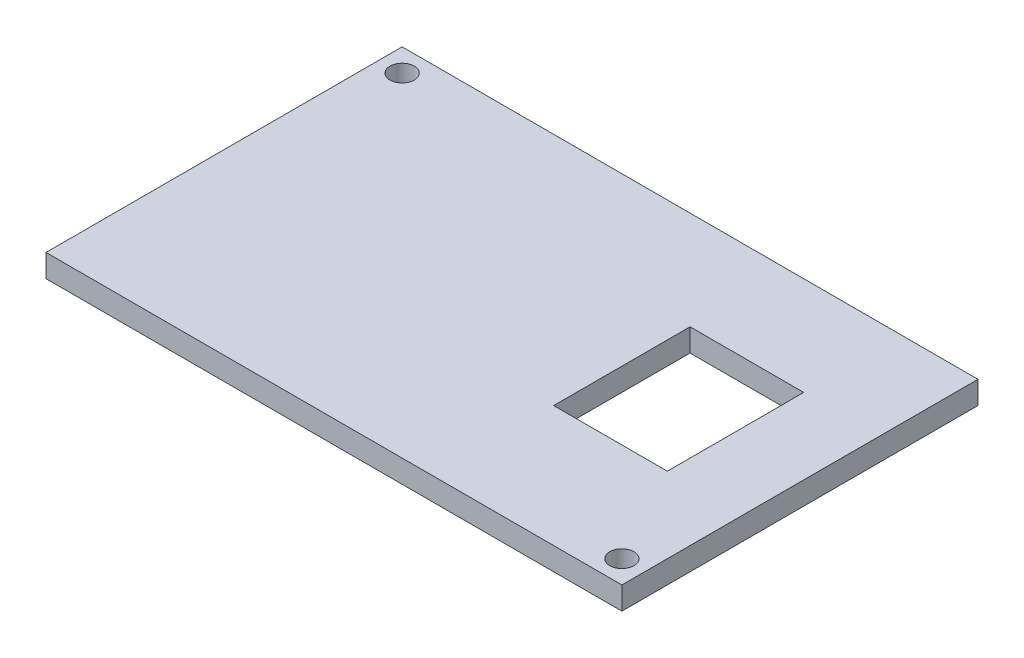
ISO-10303-21;
HEADER;
FILE_DESCRIPTION(('STEP AP214'),'2;1');
FILE_NAME('part.step','',(''),(''),'','','');
FILE_SCHEMA(('AUTOMOTIVE_DESIGN { 1 0 10303 214 1 1 1 1 }'));
ENDSEC;
DATA;
#1=APPLICATION_CONTEXT('core data for automotive mechanical design processes');
#2=APPLICATION_PROTOCOL_DEFINITION('international standard','automotive_design',2000,#1);
#3=PRODUCT_CONTEXT('',#1,'mechanical');
#4=PRODUCT('Part','Part','',(#3));
#5=PRODUCT_RELATED_PRODUCT_CATEGORY('part','',(#4));
#6=PRODUCT_DEFINITION_FORMATION('','',#4);
#7=PRODUCT_DEFINITION_CONTEXT('part definition',#1,'design');
#8=PRODUCT_DEFINITION('design','',#6,#7);
#9=PRODUCT_DEFINITION_SHAPE('','',#8);
#10=(LENGTH_UNIT() NAMED_UNIT(*) SI_UNIT(.MILLI.,.METRE.));
#11=(NAMED_UNIT(*) PLANE_ANGLE_UNIT() SI_UNIT($,.RADIAN.));
#12=(NAMED_UNIT(*) SI_UNIT($,.STERADIAN.) SOLID_ANGLE_UNIT());
#13=UNCERTAINTY_MEASURE_WITH_UNIT(LENGTH_MEASURE(1.E-05),#10,'distance_accuracy_value','');
#14=(GEOMETRIC_REPRESENTATION_CONTEXT(3) GLOBAL_UNCERTAINTY_ASSIGNED_CONTEXT((#13)) GLOBAL_UNIT_ASSIGNED_CONTEXT((#10,
#11,#12)) REPRESENTATION_CONTEXT('',''));
#15=CARTESIAN_POINT('',(0.,0.,0.));
#16=DIRECTION('',(0.,0.,1.));
#17=DIRECTION('',(1.,0.,0.));
#18=AXIS2_PLACEMENT_3D('',#15,#16,#17);
#19=CARTESIAN_POINT('',(-546.907023411371,3.,-260.880936454849));
#20=DIRECTION('',(-1.,0.,0.));
#21=DIRECTION('',(0.,0.,1.));
#22=AXIS2_PLACEMENT_3D('',#19,#20,#21);
#23=PLANE('',#22);
#24=DIRECTION('',(0.,0.,-1.));
#25=VECTOR('',#24,1.);
#26=CARTESIAN_POINT('',(-546.907023411371,0.,-260.880936454849));
#27=LINE('',#26,#25);
#28=CARTESIAN_POINT('',(-546.907023411371,0.,-213.880936454849));
#29=VERTEX_POINT('',#28);
#30=CARTESIAN_POINT('',(-546.907023411371,0.,-260.880936454849));
#31=VERTEX_POINT('',#30);
#32=EDGE_CURVE('E137',#29,#31,#27,.T.);
#33=ORIENTED_EDGE('',*,*,#32,.T.);
#34=DIRECTION('',(0.,-1.,0.));
#35=VECTOR('',#34,1.);
#36=CARTESIAN_POINT('',(-546.907023411371,3.,-260.880936454849));
#37=LINE('',#36,#35);
#38=CARTESIAN_POINT('',(-546.907023411371,3.,-260.880936454849));
#39=VERTEX_POINT('',#38);
#40=EDGE_CURVE('E11',#39,#31,#37,.T.);
#41=ORIENTED_EDGE('',*,*,#40,.F.);
#42=DIRECTION('',(0.,0.,-1.));
#43=VECTOR('',#42,1.);
#44=CARTESIAN_POINT('',(-546.907023411371,3.,-260.880936454849));
#45=LINE('',#44,#43);
#46=CARTESIAN_POINT('',(-546.907023411371,3.,-213.880936454849));
#47=VERTEX_POINT('',#46);
#48=EDGE_CURVE('E146',#47,#39,#45,.T.);
#49=ORIENTED_EDGE('',*,*,#48,.F.);
#50=DIRECTION('',(0.,-1.,0.));
#51=VECTOR('',#50,1.);
#52=CARTESIAN_POINT('',(-546.907023411371,3.,-213.880936454849));
#53=LINE('',#52,#51);
#54=EDGE_CURVE('E156',#47,#29,#53,.T.);
#55=ORIENTED_EDGE('',*,*,#54,.T.);
#56=EDGE_LOOP('',(#33,#41,#49,#55));
#57=FACE_BOUND('',#56,.T.);
#58=ADVANCED_FACE('F33',(#57),#23,.F.);
#59=CARTESIAN_POINT('',(-546.907023411371,3.,-260.880936454849));
#60=DIRECTION('',(0.,0.,1.));
#61=DIRECTION('',(1.,0.,0.));
#62=AXIS2_PLACEMENT_3D('',#59,#60,#61);
#63=PLANE('',#62);
#64=DIRECTION('',(-1.,0.,0.));
#65=VECTOR('',#64,1.);
#66=CARTESIAN_POINT('',(-546.907023411371,0.,-260.880936454849));
#67=LINE('',#66,#65);
#68=CARTESIAN_POINT('',(-622.907023411371,0.,-260.880936454849));
#69=VERTEX_POINT('',#68);
#70=EDGE_CURVE('E159',#31,#69,#67,.T.);
#71=ORIENTED_EDGE('',*,*,#70,.T.);
#72=DIRECTION('',(0.,-1.,0.));
#73=VECTOR('',#72,1.);
#74=CARTESIAN_POINT('',(-622.907023411371,3.,-260.880936454849));
#75=LINE('',#74,#73);
#76=CARTESIAN_POINT('',(-622.907023411371,3.,-260.880936454849));
#77=VERTEX_POINT('',#76);
#78=EDGE_CURVE('E40',#77,#69,#75,.T.);
#79=ORIENTED_EDGE('',*,*,#78,.F.);
#80=DIRECTION('',(-1.,0.,0.));
#81=VECTOR('',#80,1.);
#82=CARTESIAN_POINT('',(-546.907023411371,3.,-260.880936454849));
#83=LINE('',#82,#81);
#84=EDGE_CURVE('E149',#39,#77,#83,.T.);
#85=ORIENTED_EDGE('',*,*,#84,.F.);
#86=ORIENTED_EDGE('',*,*,#40,.T.);
#87=EDGE_LOOP('',(#71,#79,#85,#86));
#88=FACE_BOUND('',#87,.T.);
#89=ADVANCED_FACE('F188',(#88),#63,.F.);
#90=CARTESIAN_POINT('',(-622.907023411371,3.,-260.880936454849));
#91=DIRECTION('',(1.,0.,0.));
#92=DIRECTION('',(0.,0.,-1.));
#93=AXIS2_PLACEMENT_3D('',#90,#91,#92);
#94=PLANE('',#93);
#95=DIRECTION('',(0.,0.,1.));
#96=VECTOR('',#95,1.);
#97=CARTESIAN_POINT('',(-622.907023411371,0.,-260.880936454849));
#98=LINE('',#97,#96);
#99=CARTESIAN_POINT('',(-622.907023411371,0.,-213.880936454849));
#100=VERTEX_POINT('',#99);
#101=EDGE_CURVE('E161',#69,#100,#98,.T.);
#102=ORIENTED_EDGE('',*,*,#101,.T.);
#103=DIRECTION('',(0.,-1.,0.));
#104=VECTOR('',#103,1.);
#105=CARTESIAN_POINT('',(-622.907023411371,3.,-213.880936454849));
#106=LINE('',#105,#104);
#107=CARTESIAN_POINT('',(-622.907023411371,3.,-213.880936454849));
#108=VERTEX_POINT('',#107);
#109=EDGE_CURVE('E166',#108,#100,#106,.T.);
#110=ORIENTED_EDGE('',*,*,#109,.F.);
#111=DIRECTION('',(0.,0.,1.));
#112=VECTOR('',#111,1.);
#113=CARTESIAN_POINT('',(-622.907023411371,3.,-260.880936454849));
#114=LINE('',#113,#112);
#115=EDGE_CURVE('E152',#77,#108,#114,.T.);
#116=ORIENTED_EDGE('',*,*,#115,.F.);
#117=ORIENTED_EDGE('',*,*,#78,.T.);
#118=EDGE_LOOP('',(#102,#110,#116,#117));
#119=FACE_BOUND('',#118,.T.);
#120=ADVANCED_FACE('F173',(#119),#94,.F.);
#121=CARTESIAN_POINT('',(-546.907023411371,3.,-213.880936454849));
#122=DIRECTION('',(0.,0.,-1.));
#123=DIRECTION('',(-1.,0.,0.));
#124=AXIS2_PLACEMENT_3D('',#121,#122,#123);
#125=PLANE('',#124);
#126=DIRECTION('',(1.,0.,0.));
#127=VECTOR('',#126,1.);
#128=CARTESIAN_POINT('',(-546.907023411371,0.,-213.880936454849));
#129=LINE('',#128,#127);
#130=EDGE_CURVE('E150',#100,#29,#129,.T.);
#131=ORIENTED_EDGE('',*,*,#130,.T.);
#132=ORIENTED_EDGE('',*,*,#54,.F.);
#133=DIRECTION('',(1.,0.,0.));
#134=VECTOR('',#133,1.);
#135=CARTESIAN_POINT('',(-546.907023411371,3.,-213.880936454849));
#136=LINE('',#135,#134);
#137=EDGE_CURVE('E154',#108,#47,#136,.T.);
#138=ORIENTED_EDGE('',*,*,#137,.F.);
#139=ORIENTED_EDGE('',*,*,#109,.T.);
#140=EDGE_LOOP('',(#131,#132,#138,#139));
#141=FACE_BOUND('',#140,.T.);
#142=ADVANCED_FACE('F181',(#141),#125,.F.);
#143=CARTESIAN_POINT('',(0.,3.,0.));
#144=DIRECTION('',(0.,-1.,0.));
#145=DIRECTION('',(0.,0.,-1.));
#146=AXIS2_PLACEMENT_3D('',#143,#144,#145);
#147=PLANE('',#146);
#148=DIRECTION('',(1.,0.,0.));
#149=VECTOR('',#148,1.);
#150=CARTESIAN_POINT('',(-571.907023411371,3.,-229.880936454849));
#151=LINE('',#150,#149);
#152=CARTESIAN_POINT('',(-571.907023411371,3.,-229.880936454849));
#153=VERTEX_POINT('',#152);
#154=CARTESIAN_POINT('',(-556.907023411371,3.,-229.880936454849));
#155=VERTEX_POINT('',#154);
#156=EDGE_CURVE('E124',#153,#155,#151,.T.);
#157=ORIENTED_EDGE('',*,*,#156,.F.);
#158=DIRECTION('',(0.,0.,1.));
#159=VECTOR('',#158,1.);
#160=CARTESIAN_POINT('',(-571.907023411371,3.,-247.880936454849));
#161=LINE('',#160,#159);
#162=CARTESIAN_POINT('',(-571.907023411371,3.,-247.880936454849));
#163=VERTEX_POINT('',#162);
#164=EDGE_CURVE('E47',#163,#153,#161,.T.);
#165=ORIENTED_EDGE('',*,*,#164,.F.);
#166=DIRECTION('',(-1.,0.,0.));
#167=VECTOR('',#166,1.);
#168=CARTESIAN_POINT('',(-571.907023411371,3.,-247.880936454849));
#169=LINE('',#168,#167);
#170=CARTESIAN_POINT('',(-556.907023411371,3.,-247.880936454849));
#171=VERTEX_POINT('',#170);
#172=EDGE_CURVE('E115',#171,#163,#169,.T.);
#173=ORIENTED_EDGE('',*,*,#172,.F.);
#174=DIRECTION('',(0.,0.,-1.));
#175=VECTOR('',#174,1.);
#176=CARTESIAN_POINT('',(-556.907023411371,3.,-247.880936454849));
#177=LINE('',#176,#175);
#178=EDGE_CURVE('E118',#155,#171,#177,.T.);
#179=ORIENTED_EDGE('',*,*,#178,.F.);
#180=EDGE_LOOP('',(#157,#165,#173,#179));
#181=FACE_BOUND('',#180,.T.);
#182=CARTESIAN_POINT('',(-619.907023411371,3.,-257.880936454849));
#183=DIRECTION('',(0.,1.,0.));
#184=DIRECTION('',(0.,0.,1.));
#185=AXIS2_PLACEMENT_3D('',#182,#183,#184);
#186=CIRCLE('',#185,1.60000000000002);
#187=CARTESIAN_POINT('',(-619.907023411371,3.,-256.280936454849));
#188=VERTEX_POINT('',#187);
#189=EDGE_CURVE('E138',#188,#188,#186,.T.);
#190=ORIENTED_EDGE('',*,*,#189,.F.);
#191=EDGE_LOOP('',(#190));
#192=FACE_BOUND('',#191,.T.);
#193=CARTESIAN_POINT('',(-549.907023411371,3.,-216.880936454849));
#194=DIRECTION('',(0.,1.,0.));
#195=DIRECTION('',(0.,0.,1.));
#196=AXIS2_PLACEMENT_3D('',#193,#194,#195);
#197=CIRCLE('',#196,1.60000000000002);
#198=CARTESIAN_POINT('',(-549.907023411371,3.,-215.280936454849));
#199=VERTEX_POINT('',#198);
#200=EDGE_CURVE('E130',#199,#199,#197,.T.);
#201=ORIENTED_EDGE('',*,*,#200,.F.);
#202=EDGE_LOOP('',(#201));
#203=FACE_BOUND('',#202,.T.);
#204=ORIENTED_EDGE('',*,*,#48,.T.);
#205=ORIENTED_EDGE('',*,*,#84,.T.);
#206=ORIENTED_EDGE('',*,*,#115,.T.);
#207=ORIENTED_EDGE('',*,*,#137,.T.);
#208=EDGE_LOOP('',(#204,#205,#206,#207));
#209=FACE_BOUND('',#208,.T.);
#210=ADVANCED_FACE('F187',(#181,#192,#203,#209),#147,.F.);
#211=CARTESIAN_POINT('',(0.,0.,0.));
#212=DIRECTION('',(0.,-1.,0.));
#213=DIRECTION('',(0.,0.,-1.));
#214=AXIS2_PLACEMENT_3D('',#211,#212,#213);
#215=PLANE('',#214);
#216=DIRECTION('',(0.,0.,1.));
#217=VECTOR('',#216,1.);
#218=CARTESIAN_POINT('',(-571.907023411371,0.,-247.880936454849));
#219=LINE('',#218,#217);
#220=CARTESIAN_POINT('',(-571.907023411371,0.,-247.880936454849));
#221=VERTEX_POINT('',#220);
#222=CARTESIAN_POINT('',(-571.907023411371,0.,-229.880936454849));
#223=VERTEX_POINT('',#222);
#224=EDGE_CURVE('E99',#221,#223,#219,.T.);
#225=ORIENTED_EDGE('',*,*,#224,.T.);
#226=DIRECTION('',(1.,0.,0.));
#227=VECTOR('',#226,1.);
#228=CARTESIAN_POINT('',(-571.907023411371,0.,-229.880936454849));
#229=LINE('',#228,#227);
#230=CARTESIAN_POINT('',(-556.907023411371,0.,-229.880936454849));
#231=VERTEX_POINT('',#230);
#232=EDGE_CURVE('E108',#223,#231,#229,.T.);
#233=ORIENTED_EDGE('',*,*,#232,.T.);
#234=DIRECTION('',(0.,0.,-1.));
#235=VECTOR('',#234,1.);
#236=CARTESIAN_POINT('',(-556.907023411371,0.,-247.880936454849));
#237=LINE('',#236,#235);
#238=CARTESIAN_POINT('',(-556.907023411371,0.,-247.880936454849));
#239=VERTEX_POINT('',#238);
#240=EDGE_CURVE('E55',#231,#239,#237,.T.);
#241=ORIENTED_EDGE('',*,*,#240,.T.);
#242=DIRECTION('',(-1.,0.,0.));
#243=VECTOR('',#242,1.);
#244=CARTESIAN_POINT('',(-571.907023411371,0.,-247.880936454849));
#245=LINE('',#244,#243);
#246=EDGE_CURVE('E105',#239,#221,#245,.T.);
#247=ORIENTED_EDGE('',*,*,#246,.T.);
#248=EDGE_LOOP('',(#225,#233,#241,#247));
#249=FACE_BOUND('',#248,.T.);
#250=CARTESIAN_POINT('',(-619.907023411371,0.,-257.880936454849));
#251=DIRECTION('',(0.,1.,0.));
#252=DIRECTION('',(0.,0.,1.));
#253=AXIS2_PLACEMENT_3D('',#250,#251,#252);
#254=CIRCLE('',#253,1.60000000000002);
#255=CARTESIAN_POINT('',(-619.907023411371,0.,-256.280936454849));
#256=VERTEX_POINT('',#255);
#257=EDGE_CURVE('E134',#256,#256,#254,.T.);
#258=ORIENTED_EDGE('',*,*,#257,.T.);
#259=EDGE_LOOP('',(#258));
#260=FACE_BOUND('',#259,.T.);
#261=CARTESIAN_POINT('',(-549.907023411371,0.,-216.880936454849));
#262=DIRECTION('',(0.,1.,0.));
#263=DIRECTION('',(0.,0.,1.));
#264=AXIS2_PLACEMENT_3D('',#261,#262,#263);
#265=CIRCLE('',#264,1.60000000000002);
#266=CARTESIAN_POINT('',(-549.907023411371,0.,-215.280936454849));
#267=VERTEX_POINT('',#266);
#268=EDGE_CURVE('E141',#267,#267,#265,.T.);
#269=ORIENTED_EDGE('',*,*,#268,.T.);
#270=EDGE_LOOP('',(#269));
#271=FACE_BOUND('',#270,.T.);
#272=ORIENTED_EDGE('',*,*,#32,.F.);
#273=ORIENTED_EDGE('',*,*,#130,.F.);
#274=ORIENTED_EDGE('',*,*,#101,.F.);
#275=ORIENTED_EDGE('',*,*,#70,.F.);
#276=EDGE_LOOP('',(#272,#273,#274,#275));
#277=FACE_BOUND('',#276,.T.);
#278=ADVANCED_FACE('F112',(#249,#260,#271,#277),#215,.T.);
#279=CARTESIAN_POINT('',(-549.907023411371,0.,-216.880936454849));
#280=DIRECTION('',(0.,1.,0.));
#281=DIRECTION('',(0.,0.,1.));
#282=AXIS2_PLACEMENT_3D('',#279,#280,#281);
#283=CYLINDRICAL_SURFACE('',#282,1.60000000000002);
#284=ORIENTED_EDGE('',*,*,#268,.F.);
#285=EDGE_LOOP('',(#284));
#286=FACE_BOUND('',#285,.T.);
#287=ORIENTED_EDGE('',*,*,#200,.T.);
#288=EDGE_LOOP('',(#287));
#289=FACE_BOUND('',#288,.T.);
#290=ADVANCED_FACE('F200',(#286,#289),#283,.F.);
#291=CARTESIAN_POINT('',(-619.907023411371,0.,-257.880936454849));
#292=DIRECTION('',(0.,1.,0.));
#293=DIRECTION('',(0.,0.,1.));
#294=AXIS2_PLACEMENT_3D('',#291,#292,#293);
#295=CYLINDRICAL_SURFACE('',#294,1.60000000000002);
#296=ORIENTED_EDGE('',*,*,#257,.F.);
#297=EDGE_LOOP('',(#296));
#298=FACE_BOUND('',#297,.T.);
#299=ORIENTED_EDGE('',*,*,#189,.T.);
#300=EDGE_LOOP('',(#299));
#301=FACE_BOUND('',#300,.T.);
#302=ADVANCED_FACE('F206',(#298,#301),#295,.F.);
#303=CARTESIAN_POINT('',(-571.907023411371,0.,-247.880936454849));
#304=DIRECTION('',(-1.,0.,0.));
#305=DIRECTION('',(0.,0.,1.));
#306=AXIS2_PLACEMENT_3D('',#303,#304,#305);
#307=PLANE('',#306);
#308=ORIENTED_EDGE('',*,*,#164,.T.);
#309=DIRECTION('',(0.,1.,0.));
#310=VECTOR('',#309,1.);
#311=CARTESIAN_POINT('',(-571.907023411371,0.,-229.880936454849));
#312=LINE('',#311,#310);
#313=EDGE_CURVE('E95',#223,#153,#312,.T.);
#314=ORIENTED_EDGE('',*,*,#313,.F.);
#315=ORIENTED_EDGE('',*,*,#224,.F.);
#316=DIRECTION('',(0.,1.,0.));
#317=VECTOR('',#316,1.);
#318=CARTESIAN_POINT('',(-571.907023411371,0.,-247.880936454849));
#319=LINE('',#318,#317);
#320=EDGE_CURVE('E128',#221,#163,#319,.T.);
#321=ORIENTED_EDGE('',*,*,#320,.T.);
#322=EDGE_LOOP('',(#308,#314,#315,#321));
#323=FACE_BOUND('',#322,.T.);
#324=ADVANCED_FACE('F97',(#323),#307,.F.);
#325=CARTESIAN_POINT('',(-571.907023411371,0.,-247.880936454849));
#326=DIRECTION('',(0.,0.,-1.));
#327=DIRECTION('',(-1.,0.,0.));
#328=AXIS2_PLACEMENT_3D('',#325,#326,#327);
#329=PLANE('',#328);
#330=ORIENTED_EDGE('',*,*,#172,.T.);
#331=ORIENTED_EDGE('',*,*,#320,.F.);
#332=ORIENTED_EDGE('',*,*,#246,.F.);
#333=DIRECTION('',(0.,1.,0.));
#334=VECTOR('',#333,1.);
#335=CARTESIAN_POINT('',(-556.907023411371,0.,-247.880936454849));
#336=LINE('',#335,#334);
#337=EDGE_CURVE('E131',#239,#171,#336,.T.);
#338=ORIENTED_EDGE('',*,*,#337,.T.);
#339=EDGE_LOOP('',(#330,#331,#332,#338));
#340=FACE_BOUND('',#339,.T.);
#341=ADVANCED_FACE('F213',(#340),#329,.F.);
#342=CARTESIAN_POINT('',(-556.907023411371,0.,-247.880936454849));
#343=DIRECTION('',(1.,0.,0.));
#344=DIRECTION('',(0.,0.,-1.));
#345=AXIS2_PLACEMENT_3D('',#342,#343,#344);
#346=PLANE('',#345);
#347=ORIENTED_EDGE('',*,*,#178,.T.);
#348=ORIENTED_EDGE('',*,*,#337,.F.);
#349=ORIENTED_EDGE('',*,*,#240,.F.);
#350=DIRECTION('',(0.,1.,0.));
#351=VECTOR('',#350,1.);
#352=CARTESIAN_POINT('',(-556.907023411371,0.,-229.880936454849));
#353=LINE('',#352,#351);
#354=EDGE_CURVE('E104',#231,#155,#353,.T.);
#355=ORIENTED_EDGE('',*,*,#354,.T.);
#356=EDGE_LOOP('',(#347,#348,#349,#355));
#357=FACE_BOUND('',#356,.T.);
#358=ADVANCED_FACE('F216',(#357),#346,.F.);
#359=CARTESIAN_POINT('',(-571.907023411371,0.,-229.880936454849));
#360=DIRECTION('',(0.,0.,1.));
#361=DIRECTION('',(1.,0.,0.));
#362=AXIS2_PLACEMENT_3D('',#359,#360,#361);
#363=PLANE('',#362);
#364=ORIENTED_EDGE('',*,*,#156,.T.);
#365=ORIENTED_EDGE('',*,*,#354,.F.);
#366=ORIENTED_EDGE('',*,*,#232,.F.);
#367=ORIENTED_EDGE('',*,*,#313,.T.);
#368=EDGE_LOOP('',(#364,#365,#366,#367));
#369=FACE_BOUND('',#368,.T.);
#370=ADVANCED_FACE('F109',(#369),#363,.F.);
#371=CLOSED_SHELL('',(#58,#89,#120,#142,#210,#278,#290,#302,#324,#341,#358,#370));
#372=MANIFOLD_SOLID_BREP('B2',#371);
#373=ADVANCED_BREP_SHAPE_REPRESENTATION('',(#18,#372),#14);
#374=SHAPE_DEFINITION_REPRESENTATION(#9,#373);
ENDSEC;
END-ISO-10303-21;
